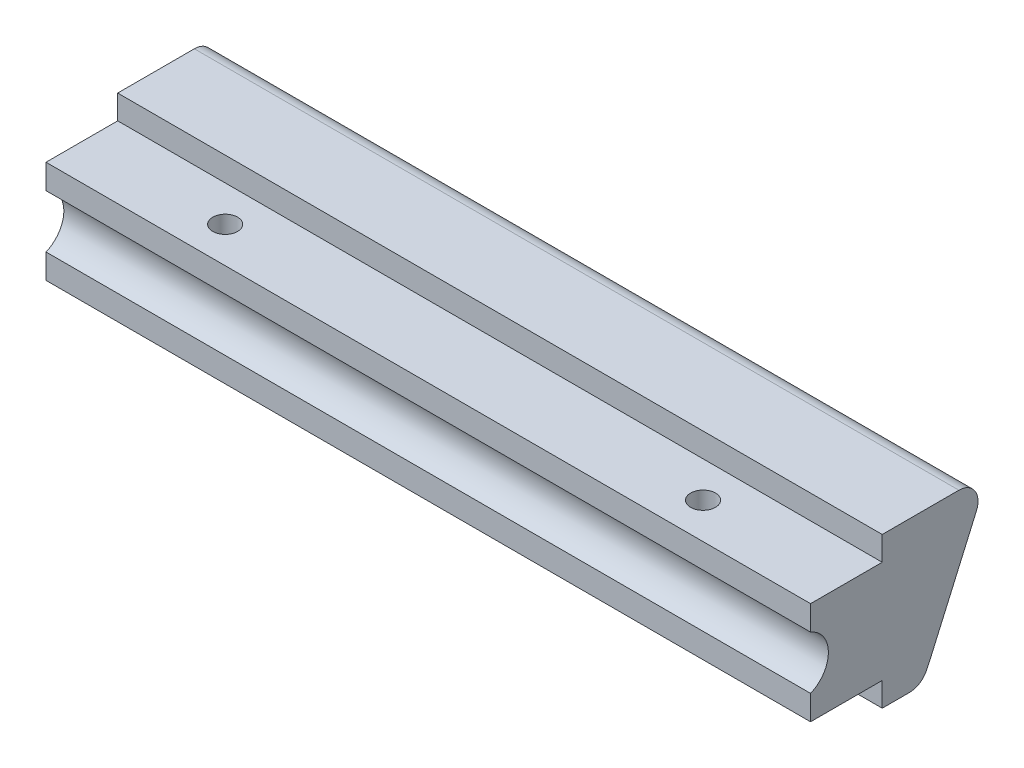
ISO-10303-21;
HEADER;
FILE_DESCRIPTION(('STEP AP214'),'2;1');
FILE_NAME('part.step','',(''),(''),'','','');
FILE_SCHEMA(('AUTOMOTIVE_DESIGN { 1 0 10303 214 1 1 1 1 }'));
ENDSEC;
DATA;
#1=APPLICATION_CONTEXT('core data for automotive mechanical design processes');
#2=APPLICATION_PROTOCOL_DEFINITION('international standard','automotive_design',2000,#1);
#3=PRODUCT_CONTEXT('',#1,'mechanical');
#4=PRODUCT('Part','Part','',(#3));
#5=PRODUCT_RELATED_PRODUCT_CATEGORY('part','',(#4));
#6=PRODUCT_DEFINITION_FORMATION('','',#4);
#7=PRODUCT_DEFINITION_CONTEXT('part definition',#1,'design');
#8=PRODUCT_DEFINITION('design','',#6,#7);
#9=PRODUCT_DEFINITION_SHAPE('','',#8);
#10=(LENGTH_UNIT() NAMED_UNIT(*) SI_UNIT(.MILLI.,.METRE.));
#11=(NAMED_UNIT(*) PLANE_ANGLE_UNIT() SI_UNIT($,.RADIAN.));
#12=(NAMED_UNIT(*) SI_UNIT($,.STERADIAN.) SOLID_ANGLE_UNIT());
#13=UNCERTAINTY_MEASURE_WITH_UNIT(LENGTH_MEASURE(1.E-05),#10,'distance_accuracy_value','');
#14=(GEOMETRIC_REPRESENTATION_CONTEXT(3) GLOBAL_UNCERTAINTY_ASSIGNED_CONTEXT((#13)) GLOBAL_UNIT_ASSIGNED_CONTEXT((#10,
#11,#12)) REPRESENTATION_CONTEXT('',''));
#15=CARTESIAN_POINT('',(0.,0.,0.));
#16=DIRECTION('',(0.,0.,1.));
#17=DIRECTION('',(1.,0.,0.));
#18=AXIS2_PLACEMENT_3D('',#15,#16,#17);
#19=CARTESIAN_POINT('',(101.6,16.7996,0.));
#20=DIRECTION('',(0.,0.,-1.));
#21=DIRECTION('',(0.,1.,0.));
#22=AXIS2_PLACEMENT_3D('',#19,#20,#21);
#23=PLANE('',#22);
#24=DIRECTION('',(0.,-1.,0.));
#25=VECTOR('',#24,1.);
#26=CARTESIAN_POINT('',(101.6,16.7996,0.));
#27=LINE('',#26,#25);
#28=CARTESIAN_POINT('',(101.6,6.4737188141613,0.));
#29=VERTEX_POINT('',#28);
#30=CARTESIAN_POINT('',(101.6,3.2004,0.));
#31=VERTEX_POINT('',#30);
#32=EDGE_CURVE('E145',#29,#31,#27,.T.);
#33=ORIENTED_EDGE('',*,*,#32,.F.);
#34=DIRECTION('',(-1.,0.,0.));
#35=VECTOR('',#34,1.);
#36=CARTESIAN_POINT('',(109.039264117156,6.4737188141613,0.));
#37=LINE('',#36,#35);
#38=CARTESIAN_POINT('',(0.,6.4737188141613,0.));
#39=VERTEX_POINT('',#38);
#40=EDGE_CURVE('E130',#29,#39,#37,.T.);
#41=ORIENTED_EDGE('',*,*,#40,.T.);
#42=DIRECTION('',(0.,-1.,0.));
#43=VECTOR('',#42,1.);
#44=CARTESIAN_POINT('',(0.,16.7996,0.));
#45=LINE('',#44,#43);
#46=CARTESIAN_POINT('',(0.,3.2004,0.));
#47=VERTEX_POINT('',#46);
#48=EDGE_CURVE('E143',#39,#47,#45,.T.);
#49=ORIENTED_EDGE('',*,*,#48,.T.);
#50=DIRECTION('',(-1.,0.,0.));
#51=VECTOR('',#50,1.);
#52=CARTESIAN_POINT('',(101.6,3.2004,0.));
#53=LINE('',#52,#51);
#54=EDGE_CURVE('E180',#31,#47,#53,.T.);
#55=ORIENTED_EDGE('',*,*,#54,.F.);
#56=EDGE_LOOP('',(#33,#41,#49,#55));
#57=FACE_BOUND('',#56,.T.);
#58=ADVANCED_FACE('F33',(#57),#23,.F.);
#59=CARTESIAN_POINT('',(101.6,20.,-23.603930171705));
#60=DIRECTION('',(0.,-1.,0.));
#61=DIRECTION('',(0.,0.,-1.));
#62=AXIS2_PLACEMENT_3D('',#59,#60,#61);
#63=PLANE('',#62);
#64=DIRECTION('',(0.,0.,1.));
#65=VECTOR('',#64,1.);
#66=CARTESIAN_POINT('',(101.6,20.,-23.603930171705));
#67=LINE('',#66,#65);
#68=CARTESIAN_POINT('',(101.6,20.,-19.7136079095898));
#69=VERTEX_POINT('',#68);
#70=CARTESIAN_POINT('',(101.6,20.,-9.525));
#71=VERTEX_POINT('',#70);
#72=EDGE_CURVE('E169',#69,#71,#67,.T.);
#73=ORIENTED_EDGE('',*,*,#72,.F.);
#74=DIRECTION('',(-1.,0.,0.));
#75=VECTOR('',#74,1.);
#76=CARTESIAN_POINT('',(101.6,20.,-19.7136079095898));
#77=LINE('',#76,#75);
#78=CARTESIAN_POINT('',(0.,20.,-19.7136079095898));
#79=VERTEX_POINT('',#78);
#80=EDGE_CURVE('E41',#69,#79,#77,.T.);
#81=ORIENTED_EDGE('',*,*,#80,.T.);
#82=DIRECTION('',(0.,0.,1.));
#83=VECTOR('',#82,1.);
#84=CARTESIAN_POINT('',(0.,20.,-23.603930171705));
#85=LINE('',#84,#83);
#86=CARTESIAN_POINT('',(0.,20.,-9.525));
#87=VERTEX_POINT('',#86);
#88=EDGE_CURVE('E208',#79,#87,#85,.T.);
#89=ORIENTED_EDGE('',*,*,#88,.T.);
#90=DIRECTION('',(-1.,0.,0.));
#91=VECTOR('',#90,1.);
#92=CARTESIAN_POINT('',(101.6,20.,-9.525));
#93=LINE('',#92,#91);
#94=EDGE_CURVE('E188',#71,#87,#93,.T.);
#95=ORIENTED_EDGE('',*,*,#94,.F.);
#96=EDGE_LOOP('',(#73,#81,#89,#95));
#97=FACE_BOUND('',#96,.T.);
#98=ADVANCED_FACE('F206',(#97),#63,.F.);
#99=CARTESIAN_POINT('',(101.6,20.,-9.525));
#100=DIRECTION('',(0.,0.,-1.));
#101=DIRECTION('',(-1.,0.,0.));
#102=AXIS2_PLACEMENT_3D('',#99,#100,#101);
#103=PLANE('',#102);
#104=DIRECTION('',(0.,-1.,0.));
#105=VECTOR('',#104,1.);
#106=CARTESIAN_POINT('',(0.,20.,-9.525));
#107=LINE('',#106,#105);
#108=CARTESIAN_POINT('',(0.,16.7996,-9.525));
#109=VERTEX_POINT('',#108);
#110=EDGE_CURVE('E155',#87,#109,#107,.T.);
#111=ORIENTED_EDGE('',*,*,#110,.T.);
#112=DIRECTION('',(-1.,0.,0.));
#113=VECTOR('',#112,1.);
#114=CARTESIAN_POINT('',(101.6,16.7996,-9.525));
#115=LINE('',#114,#113);
#116=CARTESIAN_POINT('',(101.6,16.7996,-9.525));
#117=VERTEX_POINT('',#116);
#118=EDGE_CURVE('E185',#117,#109,#115,.T.);
#119=ORIENTED_EDGE('',*,*,#118,.F.);
#120=DIRECTION('',(0.,-1.,0.));
#121=VECTOR('',#120,1.);
#122=CARTESIAN_POINT('',(101.6,20.,-9.525));
#123=LINE('',#122,#121);
#124=EDGE_CURVE('E232',#71,#117,#123,.T.);
#125=ORIENTED_EDGE('',*,*,#124,.F.);
#126=ORIENTED_EDGE('',*,*,#94,.T.);
#127=EDGE_LOOP('',(#111,#119,#125,#126));
#128=FACE_BOUND('',#127,.T.);
#129=ADVANCED_FACE('F254',(#128),#103,.F.);
#130=CARTESIAN_POINT('',(101.6,16.7996,-9.525));
#131=DIRECTION('',(0.,-1.,0.));
#132=DIRECTION('',(0.,0.,-1.));
#133=AXIS2_PLACEMENT_3D('',#130,#131,#132);
#134=PLANE('',#133);
#135=CARTESIAN_POINT('',(19.05,16.7996,-4.76250000000001));
#136=DIRECTION('',(0.,1.,0.));
#137=DIRECTION('',(0.,0.,1.));
#138=AXIS2_PLACEMENT_3D('',#135,#136,#137);
#139=CIRCLE('',#138,1.651);
#140=CARTESIAN_POINT('',(19.05,16.7996,-3.11150000000001));
#141=VERTEX_POINT('',#140);
#142=EDGE_CURVE('E239',#141,#141,#139,.T.);
#143=ORIENTED_EDGE('',*,*,#142,.F.);
#144=EDGE_LOOP('',(#143));
#145=FACE_BOUND('',#144,.T.);
#146=CARTESIAN_POINT('',(82.55,16.7996,-4.76250000000005));
#147=DIRECTION('',(0.,1.,0.));
#148=DIRECTION('',(0.,0.,1.));
#149=AXIS2_PLACEMENT_3D('',#146,#147,#148);
#150=CIRCLE('',#149,1.65100000000001);
#151=CARTESIAN_POINT('',(82.55,16.7996,-3.11150000000004));
#152=VERTEX_POINT('',#151);
#153=EDGE_CURVE('E240',#152,#152,#150,.T.);
#154=ORIENTED_EDGE('',*,*,#153,.F.);
#155=EDGE_LOOP('',(#154));
#156=FACE_BOUND('',#155,.T.);
#157=DIRECTION('',(0.,0.,1.));
#158=VECTOR('',#157,1.);
#159=CARTESIAN_POINT('',(0.,16.7996,-9.525));
#160=LINE('',#159,#158);
#161=CARTESIAN_POINT('',(0.,16.7996,0.));
#162=VERTEX_POINT('',#161);
#163=EDGE_CURVE('E153',#109,#162,#160,.T.);
#164=ORIENTED_EDGE('',*,*,#163,.T.);
#165=DIRECTION('',(-1.,0.,0.));
#166=VECTOR('',#165,1.);
#167=CARTESIAN_POINT('',(101.6,16.7996,0.));
#168=LINE('',#167,#166);
#169=CARTESIAN_POINT('',(101.6,16.7996,0.));
#170=VERTEX_POINT('',#169);
#171=EDGE_CURVE('E182',#170,#162,#168,.T.);
#172=ORIENTED_EDGE('',*,*,#171,.F.);
#173=DIRECTION('',(0.,0.,1.));
#174=VECTOR('',#173,1.);
#175=CARTESIAN_POINT('',(101.6,16.7996,-9.525));
#176=LINE('',#175,#174);
#177=EDGE_CURVE('E230',#117,#170,#176,.T.);
#178=ORIENTED_EDGE('',*,*,#177,.F.);
#179=ORIENTED_EDGE('',*,*,#118,.T.);
#180=EDGE_LOOP('',(#164,#172,#178,#179));
#181=FACE_BOUND('',#180,.T.);
#182=ADVANCED_FACE('F250',(#145,#156,#181),#134,.F.);
#183=CARTESIAN_POINT('',(0.,13.5262811858387,0.));
#184=VERTEX_POINT('',#183);
#185=EDGE_CURVE('E152',#162,#184,#45,.T.);
#186=ORIENTED_EDGE('',*,*,#185,.T.);
#187=DIRECTION('',(-1.,0.,0.));
#188=VECTOR('',#187,1.);
#189=CARTESIAN_POINT('',(109.039264117156,13.5262811858387,0.));
#190=LINE('',#189,#188);
#191=CARTESIAN_POINT('',(101.6,13.5262811858387,0.));
#192=VERTEX_POINT('',#191);
#193=EDGE_CURVE('E133',#192,#184,#190,.T.);
#194=ORIENTED_EDGE('',*,*,#193,.F.);
#195=EDGE_CURVE('E227',#170,#192,#27,.T.);
#196=ORIENTED_EDGE('',*,*,#195,.F.);
#197=ORIENTED_EDGE('',*,*,#171,.T.);
#198=EDGE_LOOP('',(#186,#194,#196,#197));
#199=FACE_BOUND('',#198,.T.);
#200=ADVANCED_FACE('F253',(#199),#23,.F.);
#201=CARTESIAN_POINT('',(101.6,3.2004,0.));
#202=DIRECTION('',(0.,1.,0.));
#203=DIRECTION('',(0.,0.,1.));
#204=AXIS2_PLACEMENT_3D('',#201,#202,#203);
#205=PLANE('',#204);
#206=CARTESIAN_POINT('',(19.05,3.2004,-4.76250000000001));
#207=DIRECTION('',(0.,1.,0.));
#208=DIRECTION('',(0.,0.,1.));
#209=AXIS2_PLACEMENT_3D('',#206,#207,#208);
#210=CIRCLE('',#209,1.651);
#211=CARTESIAN_POINT('',(19.05,3.2004,-3.11150000000002));
#212=VERTEX_POINT('',#211);
#213=EDGE_CURVE('E138',#212,#212,#210,.F.);
#214=ORIENTED_EDGE('',*,*,#213,.F.);
#215=EDGE_LOOP('',(#214));
#216=FACE_BOUND('',#215,.T.);
#217=CARTESIAN_POINT('',(82.55,3.2004,-4.76250000000005));
#218=DIRECTION('',(0.,1.,0.));
#219=DIRECTION('',(0.,0.,1.));
#220=AXIS2_PLACEMENT_3D('',#217,#218,#219);
#221=CIRCLE('',#220,1.65100000000001);
#222=CARTESIAN_POINT('',(82.55,3.2004,-3.11150000000005));
#223=VERTEX_POINT('',#222);
#224=EDGE_CURVE('E236',#223,#223,#221,.F.);
#225=ORIENTED_EDGE('',*,*,#224,.F.);
#226=EDGE_LOOP('',(#225));
#227=FACE_BOUND('',#226,.T.);
#228=DIRECTION('',(0.,0.,-1.));
#229=VECTOR('',#228,1.);
#230=CARTESIAN_POINT('',(0.,3.2004,0.));
#231=LINE('',#230,#229);
#232=CARTESIAN_POINT('',(0.,3.2004,-9.525));
#233=VERTEX_POINT('',#232);
#234=EDGE_CURVE('E151',#47,#233,#231,.T.);
#235=ORIENTED_EDGE('',*,*,#234,.T.);
#236=DIRECTION('',(-1.,0.,0.));
#237=VECTOR('',#236,1.);
#238=CARTESIAN_POINT('',(101.6,3.2004,-9.525));
#239=LINE('',#238,#237);
#240=CARTESIAN_POINT('',(101.6,3.2004,-9.525));
#241=VERTEX_POINT('',#240);
#242=EDGE_CURVE('E177',#241,#233,#239,.T.);
#243=ORIENTED_EDGE('',*,*,#242,.F.);
#244=DIRECTION('',(0.,0.,-1.));
#245=VECTOR('',#244,1.);
#246=CARTESIAN_POINT('',(101.6,3.2004,0.));
#247=LINE('',#246,#245);
#248=EDGE_CURVE('E225',#31,#241,#247,.T.);
#249=ORIENTED_EDGE('',*,*,#248,.F.);
#250=ORIENTED_EDGE('',*,*,#54,.T.);
#251=EDGE_LOOP('',(#235,#243,#249,#250));
#252=FACE_BOUND('',#251,.T.);
#253=ADVANCED_FACE('F278',(#216,#227,#252),#205,.F.);
#254=CARTESIAN_POINT('',(101.6,3.2004,-9.525));
#255=DIRECTION('',(0.,0.,-1.));
#256=DIRECTION('',(0.,1.,0.));
#257=AXIS2_PLACEMENT_3D('',#254,#255,#256);
#258=PLANE('',#257);
#259=DIRECTION('',(0.,-1.,0.));
#260=VECTOR('',#259,1.);
#261=CARTESIAN_POINT('',(0.,3.2004,-9.525));
#262=LINE('',#261,#260);
#263=CARTESIAN_POINT('',(0.,0.,-9.525));
#264=VERTEX_POINT('',#263);
#265=EDGE_CURVE('E160',#233,#264,#262,.T.);
#266=ORIENTED_EDGE('',*,*,#265,.T.);
#267=DIRECTION('',(-1.,0.,0.));
#268=VECTOR('',#267,1.);
#269=CARTESIAN_POINT('',(101.6,0.,-9.525));
#270=LINE('',#269,#268);
#271=CARTESIAN_POINT('',(101.6,0.,-9.525));
#272=VERTEX_POINT('',#271);
#273=EDGE_CURVE('E173',#272,#264,#270,.T.);
#274=ORIENTED_EDGE('',*,*,#273,.F.);
#275=DIRECTION('',(0.,-1.,0.));
#276=VECTOR('',#275,1.);
#277=CARTESIAN_POINT('',(101.6,3.2004,-9.525));
#278=LINE('',#277,#276);
#279=EDGE_CURVE('E223',#241,#272,#278,.T.);
#280=ORIENTED_EDGE('',*,*,#279,.F.);
#281=ORIENTED_EDGE('',*,*,#242,.T.);
#282=EDGE_LOOP('',(#266,#274,#280,#281));
#283=FACE_BOUND('',#282,.T.);
#284=ADVANCED_FACE('F282',(#283),#258,.F.);
#285=CARTESIAN_POINT('',(101.6,0.,-14.605));
#286=DIRECTION('',(0.,1.,0.));
#287=DIRECTION('',(0.,0.,1.));
#288=AXIS2_PLACEMENT_3D('',#285,#286,#287);
#289=PLANE('',#288);
#290=DIRECTION('',(0.,0.,-1.));
#291=VECTOR('',#290,1.);
#292=CARTESIAN_POINT('',(0.,0.,-14.605));
#293=LINE('',#292,#291);
#294=CARTESIAN_POINT('',(0.,0.,-13.1269577210068));
#295=VERTEX_POINT('',#294);
#296=EDGE_CURVE('E162',#264,#295,#293,.T.);
#297=ORIENTED_EDGE('',*,*,#296,.T.);
#298=DIRECTION('',(-1.,0.,0.));
#299=VECTOR('',#298,1.);
#300=CARTESIAN_POINT('',(101.6,0.,-13.1269577210068));
#301=LINE('',#300,#299);
#302=CARTESIAN_POINT('',(101.6,0.,-13.1269577210068));
#303=VERTEX_POINT('',#302);
#304=EDGE_CURVE('E198',#295,#303,#301,.F.);
#305=ORIENTED_EDGE('',*,*,#304,.T.);
#306=DIRECTION('',(0.,0.,-1.));
#307=VECTOR('',#306,1.);
#308=CARTESIAN_POINT('',(101.6,0.,-14.605));
#309=LINE('',#308,#307);
#310=EDGE_CURVE('E220',#272,#303,#309,.T.);
#311=ORIENTED_EDGE('',*,*,#310,.F.);
#312=ORIENTED_EDGE('',*,*,#273,.T.);
#313=EDGE_LOOP('',(#297,#305,#311,#312));
#314=FACE_BOUND('',#313,.T.);
#315=ADVANCED_FACE('F287',(#314),#289,.F.);
#316=CARTESIAN_POINT('',(101.6,10.0000002134811,1.44191197545425));
#317=DIRECTION('',(-1.,0.,0.));
#318=DIRECTION('',(0.,0.,1.));
#319=AXIS2_PLACEMENT_3D('',#316,#317,#318);
#320=CYLINDRICAL_SURFACE('',#319,18.90776);
#321=CARTESIAN_POINT('',(101.6,10.0000002134811,1.44191197545425));
#322=DIRECTION('',(1.,0.,0.));
#323=DIRECTION('',(0.,0.,1.));
#324=AXIS2_PLACEMENT_3D('',#321,#322,#323);
#325=CIRCLE('',#324,18.90776);
#326=CARTESIAN_POINT('',(101.6,1.38233392093713,-15.387800318223));
#327=VERTEX_POINT('',#326);
#328=CARTESIAN_POINT('',(101.6,2.39439280593137,-15.8687241821173));
#329=VERTEX_POINT('',#328);
#330=EDGE_CURVE('E218',#327,#329,#325,.T.);
#331=ORIENTED_EDGE('',*,*,#330,.F.);
#332=DIRECTION('',(-1.,0.,0.));
#333=VECTOR('',#332,1.);
#334=CARTESIAN_POINT('',(101.6,1.38233392093713,-15.387800318223));
#335=LINE('',#334,#333);
#336=CARTESIAN_POINT('',(0.,1.38233392093713,-15.387800318223));
#337=VERTEX_POINT('',#336);
#338=EDGE_CURVE('E191',#327,#337,#335,.T.);
#339=ORIENTED_EDGE('',*,*,#338,.T.);
#340=CARTESIAN_POINT('',(0.,10.0000002134811,1.44191197545425));
#341=DIRECTION('',(1.,0.,0.));
#342=DIRECTION('',(0.,0.,1.));
#343=AXIS2_PLACEMENT_3D('',#340,#341,#342);
#344=CIRCLE('',#343,18.90776);
#345=CARTESIAN_POINT('',(0.,2.39439280593137,-15.8687241821173));
#346=VERTEX_POINT('',#345);
#347=EDGE_CURVE('E165',#337,#346,#344,.T.);
#348=ORIENTED_EDGE('',*,*,#347,.T.);
#349=DIRECTION('',(-1.,0.,0.));
#350=VECTOR('',#349,1.);
#351=CARTESIAN_POINT('',(101.6,2.39439280593137,-15.8687241821173));
#352=LINE('',#351,#350);
#353=EDGE_CURVE('E170',#329,#346,#352,.T.);
#354=ORIENTED_EDGE('',*,*,#353,.F.);
#355=EDGE_LOOP('',(#331,#339,#348,#354));
#356=FACE_BOUND('',#355,.T.);
#357=ADVANCED_FACE('F295',(#356),#320,.T.);
#358=CARTESIAN_POINT('',(101.6,20.,-23.603930171705));
#359=DIRECTION('',(0.,0.402247934580816,0.915530774537627));
#360=DIRECTION('',(0.,-0.915530774537627,0.402247934580816));
#361=AXIS2_PLACEMENT_3D('',#358,#359,#360);
#362=PLANE('',#361);
#363=DIRECTION('',(0.,0.915530774537627,-0.402247934580816));
#364=VECTOR('',#363,1.);
#365=CARTESIAN_POINT('',(0.,20.,-23.603930171705));
#366=LINE('',#365,#364);
#367=CARTESIAN_POINT('',(0.,16.4382902461647,-22.0390560769154));
#368=VERTEX_POINT('',#367);
#369=EDGE_CURVE('E167',#346,#368,#366,.T.);
#370=ORIENTED_EDGE('',*,*,#369,.T.);
#371=DIRECTION('',(-1.,0.,0.));
#372=VECTOR('',#371,1.);
#373=CARTESIAN_POINT('',(101.6,16.4382902461647,-22.0390560769154));
#374=LINE('',#373,#372);
#375=CARTESIAN_POINT('',(101.6,16.4382902461647,-22.0390560769154));
#376=VERTEX_POINT('',#375);
#377=EDGE_CURVE('E11',#368,#376,#374,.F.);
#378=ORIENTED_EDGE('',*,*,#377,.T.);
#379=DIRECTION('',(0.,0.915530774537627,-0.402247934580816));
#380=VECTOR('',#379,1.);
#381=CARTESIAN_POINT('',(101.6,20.,-23.603930171705));
#382=LINE('',#381,#380);
#383=EDGE_CURVE('E174',#329,#376,#382,.T.);
#384=ORIENTED_EDGE('',*,*,#383,.F.);
#385=ORIENTED_EDGE('',*,*,#353,.T.);
#386=EDGE_LOOP('',(#370,#378,#384,#385));
#387=FACE_BOUND('',#386,.T.);
#388=ADVANCED_FACE('F299',(#387),#362,.F.);
#389=CARTESIAN_POINT('',(101.6,10.0000002134811,1.44191197545425));
#390=DIRECTION('',(-1.,0.,0.));
#391=DIRECTION('',(0.,0.,1.));
#392=AXIS2_PLACEMENT_3D('',#389,#390,#391);
#393=PLANE('',#392);
#394=ORIENTED_EDGE('',*,*,#310,.T.);
#395=CARTESIAN_POINT('',(101.6,2.54,-13.1269577210068));
#396=DIRECTION('',(-1.,0.,0.));
#397=DIRECTION('',(0.,0.,1.));
#398=AXIS2_PLACEMENT_3D('',#395,#396,#397);
#399=CIRCLE('',#398,2.54);
#400=EDGE_CURVE('E201',#303,#327,#399,.F.);
#401=ORIENTED_EDGE('',*,*,#400,.T.);
#402=ORIENTED_EDGE('',*,*,#330,.T.);
#403=ORIENTED_EDGE('',*,*,#383,.T.);
#404=CARTESIAN_POINT('',(101.6,17.46,-19.7136079095898));
#405=DIRECTION('',(-1.,0.,0.));
#406=DIRECTION('',(0.,0.,1.));
#407=AXIS2_PLACEMENT_3D('',#404,#405,#406);
#408=CIRCLE('',#407,2.54);
#409=EDGE_CURVE('E48',#376,#69,#408,.F.);
#410=ORIENTED_EDGE('',*,*,#409,.T.);
#411=ORIENTED_EDGE('',*,*,#72,.T.);
#412=ORIENTED_EDGE('',*,*,#124,.T.);
#413=ORIENTED_EDGE('',*,*,#177,.T.);
#414=ORIENTED_EDGE('',*,*,#195,.T.);
#415=CARTESIAN_POINT('',(101.6,10.,1.44272));
#416=DIRECTION('',(-1.,0.,0.));
#417=DIRECTION('',(0.,0.,1.));
#418=AXIS2_PLACEMENT_3D('',#415,#416,#417);
#419=CIRCLE('',#418,3.81);
#420=EDGE_CURVE('E213',#29,#192,#419,.F.);
#421=ORIENTED_EDGE('',*,*,#420,.F.);
#422=ORIENTED_EDGE('',*,*,#32,.T.);
#423=ORIENTED_EDGE('',*,*,#248,.T.);
#424=ORIENTED_EDGE('',*,*,#279,.T.);
#425=EDGE_LOOP('',(#394,#401,#402,#403,#410,#411,#412,#413,#414,#421,#422,#423,#424));
#426=FACE_BOUND('',#425,.T.);
#427=ADVANCED_FACE('F263',(#426),#393,.F.);
#428=CARTESIAN_POINT('',(0.,10.0000002134811,1.44191197545425));
#429=DIRECTION('',(-1.,0.,0.));
#430=DIRECTION('',(0.,0.,1.));
#431=AXIS2_PLACEMENT_3D('',#428,#429,#430);
#432=PLANE('',#431);
#433=ORIENTED_EDGE('',*,*,#347,.F.);
#434=CARTESIAN_POINT('',(0.,2.54,-13.1269577210068));
#435=DIRECTION('',(-1.,0.,0.));
#436=DIRECTION('',(0.,0.,1.));
#437=AXIS2_PLACEMENT_3D('',#434,#435,#436);
#438=CIRCLE('',#437,2.54);
#439=EDGE_CURVE('E196',#337,#295,#438,.T.);
#440=ORIENTED_EDGE('',*,*,#439,.T.);
#441=ORIENTED_EDGE('',*,*,#296,.F.);
#442=ORIENTED_EDGE('',*,*,#265,.F.);
#443=ORIENTED_EDGE('',*,*,#234,.F.);
#444=ORIENTED_EDGE('',*,*,#48,.F.);
#445=CARTESIAN_POINT('',(0.,10.,1.44272));
#446=DIRECTION('',(-1.,0.,0.));
#447=DIRECTION('',(0.,0.,1.));
#448=AXIS2_PLACEMENT_3D('',#445,#446,#447);
#449=CIRCLE('',#448,3.81);
#450=EDGE_CURVE('E127',#184,#39,#449,.T.);
#451=ORIENTED_EDGE('',*,*,#450,.F.);
#452=ORIENTED_EDGE('',*,*,#185,.F.);
#453=ORIENTED_EDGE('',*,*,#163,.F.);
#454=ORIENTED_EDGE('',*,*,#110,.F.);
#455=ORIENTED_EDGE('',*,*,#88,.F.);
#456=CARTESIAN_POINT('',(0.,17.46,-19.7136079095898));
#457=DIRECTION('',(-1.,0.,0.));
#458=DIRECTION('',(0.,0.,1.));
#459=AXIS2_PLACEMENT_3D('',#456,#457,#458);
#460=CIRCLE('',#459,2.54);
#461=EDGE_CURVE('E194',#79,#368,#460,.T.);
#462=ORIENTED_EDGE('',*,*,#461,.T.);
#463=ORIENTED_EDGE('',*,*,#369,.F.);
#464=EDGE_LOOP('',(#433,#440,#441,#442,#443,#444,#451,#452,#453,#454,#455,#462,#463));
#465=FACE_BOUND('',#464,.T.);
#466=ADVANCED_FACE('F149',(#465),#432,.T.);
#467=CARTESIAN_POINT('',(109.039264117156,10.,1.44272));
#468=DIRECTION('',(-1.,0.,0.));
#469=DIRECTION('',(0.,0.,1.));
#470=AXIS2_PLACEMENT_3D('',#467,#468,#469);
#471=CYLINDRICAL_SURFACE('',#470,3.81);
#472=ORIENTED_EDGE('',*,*,#420,.T.);
#473=ORIENTED_EDGE('',*,*,#193,.T.);
#474=ORIENTED_EDGE('',*,*,#450,.T.);
#475=ORIENTED_EDGE('',*,*,#40,.F.);
#476=EDGE_LOOP('',(#472,#473,#474,#475));
#477=FACE_BOUND('',#476,.T.);
#478=ADVANCED_FACE('F129',(#477),#471,.F.);
#479=CARTESIAN_POINT('',(82.55,-1.46933318295597,-4.76250000000005));
#480=DIRECTION('',(0.,1.,0.));
#481=DIRECTION('',(0.,0.,1.));
#482=AXIS2_PLACEMENT_3D('',#479,#480,#481);
#483=CYLINDRICAL_SURFACE('',#482,1.65100000000001);
#484=ORIENTED_EDGE('',*,*,#224,.T.);
#485=EDGE_LOOP('',(#484));
#486=FACE_BOUND('',#485,.T.);
#487=ORIENTED_EDGE('',*,*,#153,.T.);
#488=EDGE_LOOP('',(#487));
#489=FACE_BOUND('',#488,.T.);
#490=ADVANCED_FACE('F309',(#486,#489),#483,.F.);
#491=CARTESIAN_POINT('',(19.05,-1.46933318295597,-4.76250000000002));
#492=DIRECTION('',(0.,1.,0.));
#493=DIRECTION('',(0.,0.,1.));
#494=AXIS2_PLACEMENT_3D('',#491,#492,#493);
#495=CYLINDRICAL_SURFACE('',#494,1.651);
#496=ORIENTED_EDGE('',*,*,#213,.T.);
#497=EDGE_LOOP('',(#496));
#498=FACE_BOUND('',#497,.T.);
#499=ORIENTED_EDGE('',*,*,#142,.T.);
#500=EDGE_LOOP('',(#499));
#501=FACE_BOUND('',#500,.T.);
#502=ADVANCED_FACE('F248',(#498,#501),#495,.F.);
#503=CARTESIAN_POINT('',(101.6,2.54,-13.1269577210068));
#504=DIRECTION('',(-1.,0.,0.));
#505=DIRECTION('',(0.,0.,1.));
#506=AXIS2_PLACEMENT_3D('',#503,#504,#505);
#507=CYLINDRICAL_SURFACE('',#506,2.54);
#508=ORIENTED_EDGE('',*,*,#400,.F.);
#509=ORIENTED_EDGE('',*,*,#304,.F.);
#510=ORIENTED_EDGE('',*,*,#439,.F.);
#511=ORIENTED_EDGE('',*,*,#338,.F.);
#512=EDGE_LOOP('',(#508,#509,#510,#511));
#513=FACE_BOUND('',#512,.T.);
#514=ADVANCED_FACE('F314',(#513),#507,.T.);
#515=CARTESIAN_POINT('',(101.6,17.46,-19.7136079095898));
#516=DIRECTION('',(-1.,0.,0.));
#517=DIRECTION('',(0.,0.,1.));
#518=AXIS2_PLACEMENT_3D('',#515,#516,#517);
#519=CYLINDRICAL_SURFACE('',#518,2.54);
#520=ORIENTED_EDGE('',*,*,#409,.F.);
#521=ORIENTED_EDGE('',*,*,#377,.F.);
#522=ORIENTED_EDGE('',*,*,#461,.F.);
#523=ORIENTED_EDGE('',*,*,#80,.F.);
#524=EDGE_LOOP('',(#520,#521,#522,#523));
#525=FACE_BOUND('',#524,.T.);
#526=ADVANCED_FACE('F35',(#525),#519,.T.);
#527=CLOSED_SHELL('',(#58,#98,#129,#182,#200,#253,#284,#315,#357,#388,#427,#466,#478,#490,#502,
#514,#526));
#528=MANIFOLD_SOLID_BREP('B2',#527);
#529=ADVANCED_BREP_SHAPE_REPRESENTATION('',(#18,#528),#14);
#530=SHAPE_DEFINITION_REPRESENTATION(#9,#529);
ENDSEC;
END-ISO-10303-21;
